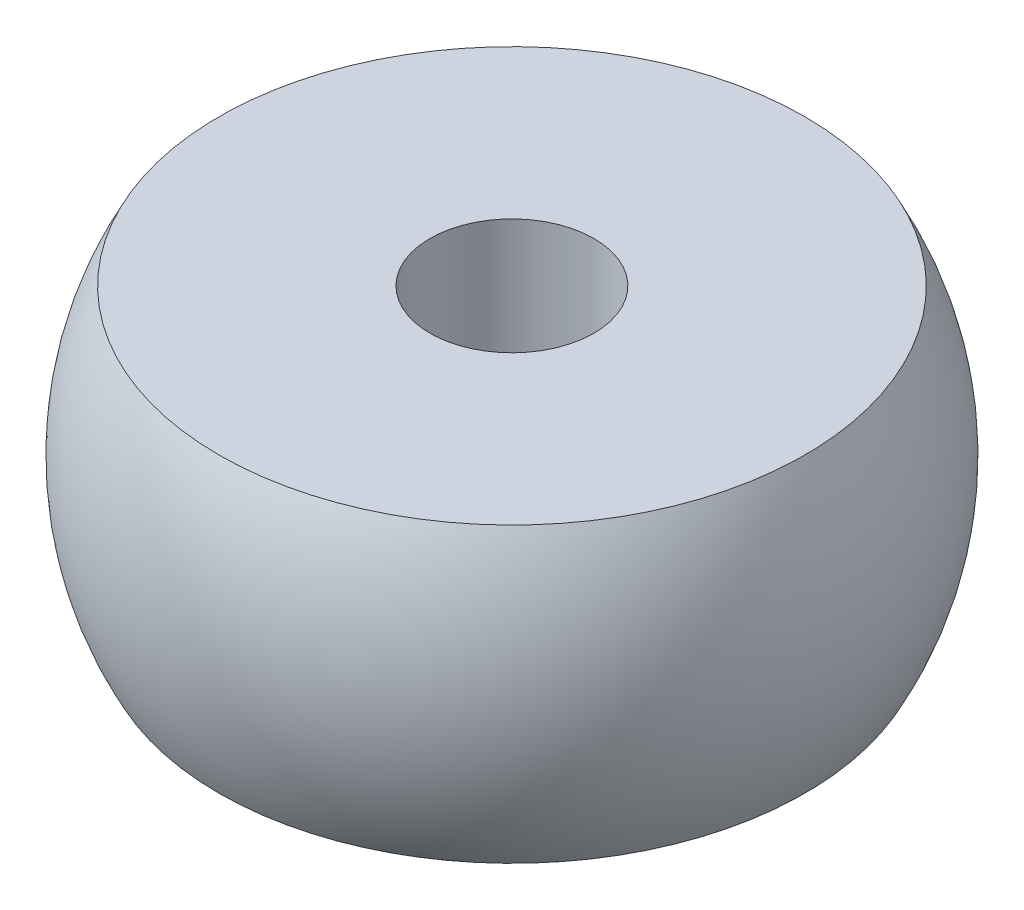
ISO-10303-21;
HEADER;
FILE_DESCRIPTION(('STEP AP214'),'2;1');
FILE_NAME('part.step','',(''),(''),'','','');
FILE_SCHEMA(('AUTOMOTIVE_DESIGN { 1 0 10303 214 1 1 1 1 }'));
ENDSEC;
DATA;
#1=APPLICATION_CONTEXT('core data for automotive mechanical design processes');
#2=APPLICATION_PROTOCOL_DEFINITION('international standard','automotive_design',2000,#1);
#3=PRODUCT_CONTEXT('',#1,'mechanical');
#4=PRODUCT('Part','Part','',(#3));
#5=PRODUCT_RELATED_PRODUCT_CATEGORY('part','',(#4));
#6=PRODUCT_DEFINITION_FORMATION('','',#4);
#7=PRODUCT_DEFINITION_CONTEXT('part definition',#1,'design');
#8=PRODUCT_DEFINITION('design','',#6,#7);
#9=PRODUCT_DEFINITION_SHAPE('','',#8);
#10=(LENGTH_UNIT() NAMED_UNIT(*) SI_UNIT(.MILLI.,.METRE.));
#11=(NAMED_UNIT(*) PLANE_ANGLE_UNIT() SI_UNIT($,.RADIAN.));
#12=(NAMED_UNIT(*) SI_UNIT($,.STERADIAN.) SOLID_ANGLE_UNIT());
#13=UNCERTAINTY_MEASURE_WITH_UNIT(LENGTH_MEASURE(1.E-05),#10,'distance_accuracy_value','');
#14=(GEOMETRIC_REPRESENTATION_CONTEXT(3) GLOBAL_UNCERTAINTY_ASSIGNED_CONTEXT((#13)) GLOBAL_UNIT_ASSIGNED_CONTEXT((#10,
#11,#12)) REPRESENTATION_CONTEXT('',''));
#15=CARTESIAN_POINT('',(0.,0.,0.));
#16=DIRECTION('',(0.,0.,1.));
#17=DIRECTION('',(1.,0.,0.));
#18=AXIS2_PLACEMENT_3D('',#15,#16,#17);
#19=CARTESIAN_POINT('',(0.,0.,0.));
#20=DIRECTION('',(0.,-1.,0.));
#21=DIRECTION('',(0.,0.,-1.));
#22=AXIS2_PLACEMENT_3D('',#19,#20,#21);
#23=DEGENERATE_TOROIDAL_SURFACE('',#22,0.396875000000009,6.74687499999999,.T.);
#24=CARTESIAN_POINT('',(0.,-3.175,0.));
#25=DIRECTION('',(0.,-1.,0.));
#26=DIRECTION('',(0.,0.,-1.));
#27=AXIS2_PLACEMENT_3D('',#24,#25,#26);
#28=CIRCLE('',#27,6.35);
#29=CARTESIAN_POINT('',(0.,-3.175,-6.35));
#30=VERTEX_POINT('',#29);
#31=EDGE_CURVE('E11',#30,#30,#28,.T.);
#32=ORIENTED_EDGE('',*,*,#31,.F.);
#33=EDGE_LOOP('',(#32));
#34=FACE_BOUND('',#33,.T.);
#35=CARTESIAN_POINT('',(0.,3.175,0.));
#36=DIRECTION('',(0.,-1.,0.));
#37=DIRECTION('',(0.,0.,-1.));
#38=AXIS2_PLACEMENT_3D('',#35,#36,#37);
#39=CIRCLE('',#38,6.35);
#40=CARTESIAN_POINT('',(0.,3.175,-6.35));
#41=VERTEX_POINT('',#40);
#42=EDGE_CURVE('E50',#41,#41,#39,.T.);
#43=ORIENTED_EDGE('',*,*,#42,.T.);
#44=EDGE_LOOP('',(#43));
#45=FACE_BOUND('',#44,.T.);
#46=ADVANCED_FACE('F36',(#34,#45),#23,.T.);
#47=CARTESIAN_POINT('',(-6.35,-3.175,0.));
#48=DIRECTION('',(0.,1.,0.));
#49=DIRECTION('',(0.,0.,1.));
#50=AXIS2_PLACEMENT_3D('',#47,#48,#49);
#51=PLANE('',#50);
#52=CARTESIAN_POINT('',(0.,-3.175,0.));
#53=DIRECTION('',(0.,-1.,0.));
#54=DIRECTION('',(0.,0.,-1.));
#55=AXIS2_PLACEMENT_3D('',#52,#53,#54);
#56=CIRCLE('',#55,1.778);
#57=CARTESIAN_POINT('',(0.,-3.175,-1.778));
#58=VERTEX_POINT('',#57);
#59=EDGE_CURVE('E42',#58,#58,#56,.T.);
#60=ORIENTED_EDGE('',*,*,#59,.F.);
#61=EDGE_LOOP('',(#60));
#62=FACE_BOUND('',#61,.T.);
#63=ORIENTED_EDGE('',*,*,#31,.T.);
#64=EDGE_LOOP('',(#63));
#65=FACE_BOUND('',#64,.T.);
#66=ADVANCED_FACE('F65',(#62,#65),#51,.F.);
#67=CARTESIAN_POINT('',(0.,0.,0.));
#68=DIRECTION('',(0.,-1.,0.));
#69=DIRECTION('',(0.,0.,-1.));
#70=AXIS2_PLACEMENT_3D('',#67,#68,#69);
#71=CYLINDRICAL_SURFACE('',#70,1.778);
#72=CARTESIAN_POINT('',(0.,3.175,0.));
#73=DIRECTION('',(0.,-1.,0.));
#74=DIRECTION('',(0.,0.,-1.));
#75=AXIS2_PLACEMENT_3D('',#72,#73,#74);
#76=CIRCLE('',#75,1.778);
#77=CARTESIAN_POINT('',(0.,3.175,-1.778));
#78=VERTEX_POINT('',#77);
#79=EDGE_CURVE('E46',#78,#78,#76,.T.);
#80=ORIENTED_EDGE('',*,*,#79,.F.);
#81=EDGE_LOOP('',(#80));
#82=FACE_BOUND('',#81,.T.);
#83=ORIENTED_EDGE('',*,*,#59,.T.);
#84=EDGE_LOOP('',(#83));
#85=FACE_BOUND('',#84,.T.);
#86=ADVANCED_FACE('F60',(#82,#85),#71,.F.);
#87=CARTESIAN_POINT('',(-6.35,3.175,0.));
#88=DIRECTION('',(0.,-1.,0.));
#89=DIRECTION('',(0.,0.,-1.));
#90=AXIS2_PLACEMENT_3D('',#87,#88,#89);
#91=PLANE('',#90);
#92=ORIENTED_EDGE('',*,*,#42,.F.);
#93=EDGE_LOOP('',(#92));
#94=FACE_BOUND('',#93,.T.);
#95=ORIENTED_EDGE('',*,*,#79,.T.);
#96=EDGE_LOOP('',(#95));
#97=FACE_BOUND('',#96,.T.);
#98=ADVANCED_FACE('F57',(#94,#97),#91,.F.);
#99=CLOSED_SHELL('',(#46,#66,#86,#98));
#100=MANIFOLD_SOLID_BREP('B2',#99);
#101=ADVANCED_BREP_SHAPE_REPRESENTATION('',(#18,#100),#14);
#102=SHAPE_DEFINITION_REPRESENTATION(#9,#101);
ENDSEC;
END-ISO-10303-21;
